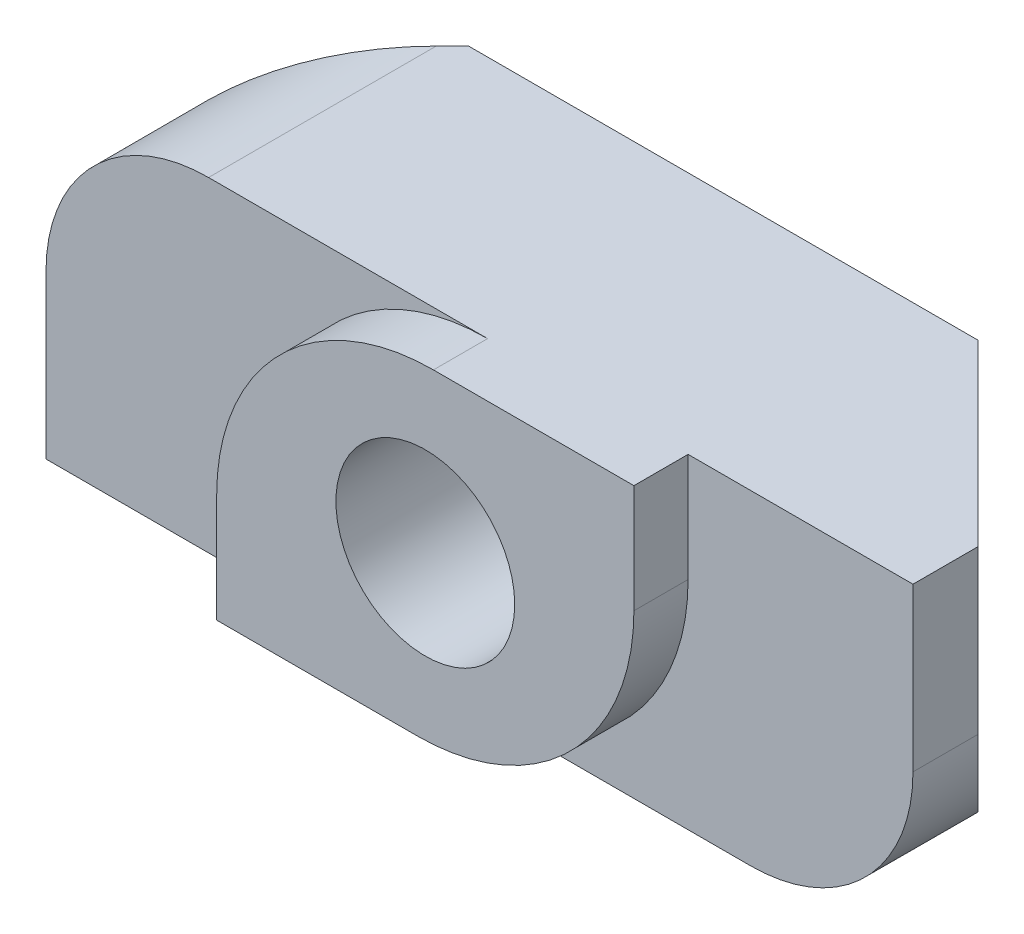
ISO-10303-21;
HEADER;
FILE_DESCRIPTION(('STEP AP214'),'2;1');
FILE_NAME('part.step','',(''),(''),'','','');
FILE_SCHEMA(('AUTOMOTIVE_DESIGN { 1 0 10303 214 1 1 1 1 }'));
ENDSEC;
DATA;
#1=APPLICATION_CONTEXT('core data for automotive mechanical design processes');
#2=APPLICATION_PROTOCOL_DEFINITION('international standard','automotive_design',2000,#1);
#3=PRODUCT_CONTEXT('',#1,'mechanical');
#4=PRODUCT('Part','Part','',(#3));
#5=PRODUCT_RELATED_PRODUCT_CATEGORY('part','',(#4));
#6=PRODUCT_DEFINITION_FORMATION('','',#4);
#7=PRODUCT_DEFINITION_CONTEXT('part definition',#1,'design');
#8=PRODUCT_DEFINITION('design','',#6,#7);
#9=PRODUCT_DEFINITION_SHAPE('','',#8);
#10=(LENGTH_UNIT() NAMED_UNIT(*) SI_UNIT(.MILLI.,.METRE.));
#11=(NAMED_UNIT(*) PLANE_ANGLE_UNIT() SI_UNIT($,.RADIAN.));
#12=(NAMED_UNIT(*) SI_UNIT($,.STERADIAN.) SOLID_ANGLE_UNIT());
#13=UNCERTAINTY_MEASURE_WITH_UNIT(LENGTH_MEASURE(1.E-05),#10,'distance_accuracy_value','');
#14=(GEOMETRIC_REPRESENTATION_CONTEXT(3) GLOBAL_UNCERTAINTY_ASSIGNED_CONTEXT((#13)) GLOBAL_UNIT_ASSIGNED_CONTEXT((#10,
#11,#12)) REPRESENTATION_CONTEXT('',''));
#15=CARTESIAN_POINT('',(0.,0.,0.));
#16=DIRECTION('',(0.,0.,1.));
#17=DIRECTION('',(1.,0.,0.));
#18=AXIS2_PLACEMENT_3D('',#15,#16,#17);
#19=CARTESIAN_POINT('',(-4.70000000000001,6.,0.));
#20=DIRECTION('',(0.707106781186549,0.,0.707106781186546));
#21=DIRECTION('',(0.707106781186546,0.,-0.707106781186549));
#22=AXIS2_PLACEMENT_3D('',#19,#20,#21);
#23=PLANE('',#22);
#24=DIRECTION('',(0.,-1.,0.));
#25=VECTOR('',#24,1.);
#26=CARTESIAN_POINT('',(-8.,6.,3.3));
#27=LINE('',#26,#25);
#28=CARTESIAN_POINT('',(-8.,3.,3.3));
#29=VERTEX_POINT('',#28);
#30=CARTESIAN_POINT('',(-8.,0.,3.3));
#31=VERTEX_POINT('',#30);
#32=EDGE_CURVE('E211',#29,#31,#27,.T.);
#33=ORIENTED_EDGE('',*,*,#32,.F.);
#34=CARTESIAN_POINT('',(-4.99999999999999,3.,0.299999999999985));
#35=DIRECTION('',(0.707106781186549,0.,0.707106781186546));
#36=DIRECTION('',(0.707106781186546,0.,-0.707106781186549));
#37=AXIS2_PLACEMENT_3D('',#34,#35,#36);
#38=ELLIPSE('',#37,4.2426406871193,3.);
#39=CARTESIAN_POINT('',(-4.99999999999999,6.,0.299999999999985));
#40=VERTEX_POINT('',#39);
#41=EDGE_CURVE('E236',#29,#40,#38,.F.);
#42=ORIENTED_EDGE('',*,*,#41,.T.);
#43=DIRECTION('',(-0.707106781186546,0.,0.707106781186549));
#44=VECTOR('',#43,1.);
#45=CARTESIAN_POINT('',(-4.70000000000001,6.,0.));
#46=LINE('',#45,#44);
#47=CARTESIAN_POINT('',(-4.70000000000001,6.,0.));
#48=VERTEX_POINT('',#47);
#49=EDGE_CURVE('E194',#48,#40,#46,.T.);
#50=ORIENTED_EDGE('',*,*,#49,.F.);
#51=DIRECTION('',(0.,-1.,0.));
#52=VECTOR('',#51,1.);
#53=CARTESIAN_POINT('',(-4.70000000000001,6.,0.));
#54=LINE('',#53,#52);
#55=CARTESIAN_POINT('',(-4.70000000000001,0.,0.));
#56=VERTEX_POINT('',#55);
#57=EDGE_CURVE('E172',#48,#56,#54,.T.);
#58=ORIENTED_EDGE('',*,*,#57,.T.);
#59=DIRECTION('',(-0.707106781186546,0.,0.707106781186549));
#60=VECTOR('',#59,1.);
#61=CARTESIAN_POINT('',(-4.70000000000001,0.,0.));
#62=LINE('',#61,#60);
#63=EDGE_CURVE('E173',#56,#31,#62,.T.);
#64=ORIENTED_EDGE('',*,*,#63,.T.);
#65=EDGE_LOOP('',(#33,#42,#50,#58,#64));
#66=FACE_BOUND('',#65,.T.);
#67=ADVANCED_FACE('F35',(#66),#23,.F.);
#68=CARTESIAN_POINT('',(-8.,6.,3.3));
#69=DIRECTION('',(1.,0.,0.));
#70=DIRECTION('',(0.,0.,-1.));
#71=AXIS2_PLACEMENT_3D('',#68,#69,#70);
#72=PLANE('',#71);
#73=DIRECTION('',(0.,-1.,0.));
#74=VECTOR('',#73,1.);
#75=CARTESIAN_POINT('',(-8.,6.,4.5));
#76=LINE('',#75,#74);
#77=CARTESIAN_POINT('',(-8.,3.,4.5));
#78=VERTEX_POINT('',#77);
#79=CARTESIAN_POINT('',(-8.,0.,4.5));
#80=VERTEX_POINT('',#79);
#81=EDGE_CURVE('E209',#78,#80,#76,.T.);
#82=ORIENTED_EDGE('',*,*,#81,.F.);
#83=DIRECTION('',(0.,0.,1.));
#84=VECTOR('',#83,1.);
#85=CARTESIAN_POINT('',(-8.,3.,3.3));
#86=LINE('',#85,#84);
#87=EDGE_CURVE('E234',#78,#29,#86,.F.);
#88=ORIENTED_EDGE('',*,*,#87,.T.);
#89=ORIENTED_EDGE('',*,*,#32,.T.);
#90=DIRECTION('',(0.,0.,1.));
#91=VECTOR('',#90,1.);
#92=CARTESIAN_POINT('',(-8.,0.,3.3));
#93=LINE('',#92,#91);
#94=EDGE_CURVE('E176',#31,#80,#93,.T.);
#95=ORIENTED_EDGE('',*,*,#94,.T.);
#96=EDGE_LOOP('',(#82,#88,#89,#95));
#97=FACE_BOUND('',#96,.T.);
#98=ADVANCED_FACE('F264',(#97),#72,.F.);
#99=CARTESIAN_POINT('',(-8.,6.,4.5));
#100=DIRECTION('',(0.,0.,-1.));
#101=DIRECTION('',(-1.,0.,0.));
#102=AXIS2_PLACEMENT_3D('',#99,#100,#101);
#103=PLANE('',#102);
#104=DIRECTION('',(1.,0.,0.));
#105=VECTOR('',#104,1.);
#106=CARTESIAN_POINT('',(-8.,6.,4.5));
#107=LINE('',#106,#105);
#108=CARTESIAN_POINT('',(-5.,6.,4.5));
#109=VERTEX_POINT('',#108);
#110=CARTESIAN_POINT('',(0.149999999999997,6.,4.5));
#111=VERTEX_POINT('',#110);
#112=EDGE_CURVE('E144',#109,#111,#107,.T.);
#113=ORIENTED_EDGE('',*,*,#112,.F.);
#114=CARTESIAN_POINT('',(-5.,3.,4.5));
#115=DIRECTION('',(0.,0.,-1.));
#116=DIRECTION('',(-1.,0.,0.));
#117=AXIS2_PLACEMENT_3D('',#114,#115,#116);
#118=CIRCLE('',#117,3.);
#119=EDGE_CURVE('E232',#109,#78,#118,.F.);
#120=ORIENTED_EDGE('',*,*,#119,.T.);
#121=ORIENTED_EDGE('',*,*,#81,.T.);
#122=DIRECTION('',(1.,0.,0.));
#123=VECTOR('',#122,1.);
#124=CARTESIAN_POINT('',(-8.,0.,4.5));
#125=LINE('',#124,#123);
#126=CARTESIAN_POINT('',(-3.85,0.,4.5));
#127=VERTEX_POINT('',#126);
#128=EDGE_CURVE('E180',#80,#127,#125,.T.);
#129=ORIENTED_EDGE('',*,*,#128,.T.);
#130=DIRECTION('',(0.,-1.,0.));
#131=VECTOR('',#130,1.);
#132=CARTESIAN_POINT('',(-3.85,6.,4.5));
#133=LINE('',#132,#131);
#134=CARTESIAN_POINT('',(-3.85,2.,4.5));
#135=VERTEX_POINT('',#134);
#136=EDGE_CURVE('E207',#135,#127,#133,.T.);
#137=ORIENTED_EDGE('',*,*,#136,.F.);
#138=CARTESIAN_POINT('',(0.15,2.,4.5));
#139=DIRECTION('',(0.,0.,-1.));
#140=DIRECTION('',(-1.,0.,0.));
#141=AXIS2_PLACEMENT_3D('',#138,#139,#140);
#142=CIRCLE('',#141,4.);
#143=EDGE_CURVE('E223',#135,#111,#142,.T.);
#144=ORIENTED_EDGE('',*,*,#143,.T.);
#145=EDGE_LOOP('',(#113,#120,#121,#129,#137,#144));
#146=FACE_BOUND('',#145,.T.);
#147=ADVANCED_FACE('F270',(#146),#103,.F.);
#148=CARTESIAN_POINT('',(-3.85,6.,4.5));
#149=DIRECTION('',(1.,0.,0.));
#150=DIRECTION('',(0.,0.,-1.));
#151=AXIS2_PLACEMENT_3D('',#148,#149,#150);
#152=PLANE('',#151);
#153=DIRECTION('',(0.,-1.,0.));
#154=VECTOR('',#153,1.);
#155=CARTESIAN_POINT('',(-3.85,6.,5.5));
#156=LINE('',#155,#154);
#157=CARTESIAN_POINT('',(-3.85,2.,5.5));
#158=VERTEX_POINT('',#157);
#159=CARTESIAN_POINT('',(-3.85,0.,5.5));
#160=VERTEX_POINT('',#159);
#161=EDGE_CURVE('E155',#158,#160,#156,.T.);
#162=ORIENTED_EDGE('',*,*,#161,.F.);
#163=DIRECTION('',(0.,0.,1.));
#164=VECTOR('',#163,1.);
#165=CARTESIAN_POINT('',(-3.85,2.,4.5));
#166=LINE('',#165,#164);
#167=EDGE_CURVE('E217',#158,#135,#166,.F.);
#168=ORIENTED_EDGE('',*,*,#167,.T.);
#169=ORIENTED_EDGE('',*,*,#136,.T.);
#170=DIRECTION('',(0.,0.,1.));
#171=VECTOR('',#170,1.);
#172=CARTESIAN_POINT('',(-3.85,0.,4.5));
#173=LINE('',#172,#171);
#174=EDGE_CURVE('E183',#127,#160,#173,.T.);
#175=ORIENTED_EDGE('',*,*,#174,.T.);
#176=EDGE_LOOP('',(#162,#168,#169,#175));
#177=FACE_BOUND('',#176,.T.);
#178=ADVANCED_FACE('F292',(#177),#152,.F.);
#179=CARTESIAN_POINT('',(-3.85,6.,5.5));
#180=DIRECTION('',(0.,0.,-1.));
#181=DIRECTION('',(-1.,0.,0.));
#182=AXIS2_PLACEMENT_3D('',#179,#180,#181);
#183=PLANE('',#182);
#184=CARTESIAN_POINT('',(0.,3.,5.5));
#185=DIRECTION('',(0.,0.,1.));
#186=DIRECTION('',(1.,0.,0.));
#187=AXIS2_PLACEMENT_3D('',#184,#185,#186);
#188=CIRCLE('',#187,1.65);
#189=CARTESIAN_POINT('',(1.65,3.,5.5));
#190=VERTEX_POINT('',#189);
#191=EDGE_CURVE('E307',#190,#190,#188,.T.);
#192=ORIENTED_EDGE('',*,*,#191,.F.);
#193=EDGE_LOOP('',(#192));
#194=FACE_BOUND('',#193,.T.);
#195=DIRECTION('',(1.,0.,0.));
#196=VECTOR('',#195,1.);
#197=CARTESIAN_POINT('',(-3.85,6.,5.5));
#198=LINE('',#197,#196);
#199=CARTESIAN_POINT('',(0.149999999999998,6.,5.5));
#200=VERTEX_POINT('',#199);
#201=CARTESIAN_POINT('',(3.85,6.,5.5));
#202=VERTEX_POINT('',#201);
#203=EDGE_CURVE('E134',#200,#202,#198,.T.);
#204=ORIENTED_EDGE('',*,*,#203,.F.);
#205=CARTESIAN_POINT('',(0.15,2.,5.5));
#206=DIRECTION('',(0.,0.,-1.));
#207=DIRECTION('',(-1.,0.,0.));
#208=AXIS2_PLACEMENT_3D('',#205,#206,#207);
#209=CIRCLE('',#208,4.);
#210=EDGE_CURVE('E215',#200,#158,#209,.F.);
#211=ORIENTED_EDGE('',*,*,#210,.T.);
#212=ORIENTED_EDGE('',*,*,#161,.T.);
#213=DIRECTION('',(1.,0.,0.));
#214=VECTOR('',#213,1.);
#215=CARTESIAN_POINT('',(-3.85,0.,5.5));
#216=LINE('',#215,#214);
#217=CARTESIAN_POINT('',(-0.150000000000001,0.,5.5));
#218=VERTEX_POINT('',#217);
#219=EDGE_CURVE('E186',#160,#218,#216,.T.);
#220=ORIENTED_EDGE('',*,*,#219,.T.);
#221=CARTESIAN_POINT('',(-0.15,4.,5.5));
#222=DIRECTION('',(0.,0.,-1.));
#223=DIRECTION('',(-1.,0.,0.));
#224=AXIS2_PLACEMENT_3D('',#221,#222,#223);
#225=CIRCLE('',#224,4.);
#226=CARTESIAN_POINT('',(3.85,4.,5.5));
#227=VERTEX_POINT('',#226);
#228=EDGE_CURVE('E151',#218,#227,#225,.F.);
#229=ORIENTED_EDGE('',*,*,#228,.T.);
#230=DIRECTION('',(0.,-1.,0.));
#231=VECTOR('',#230,1.);
#232=CARTESIAN_POINT('',(3.85,6.,5.5));
#233=LINE('',#232,#231);
#234=EDGE_CURVE('E147',#202,#227,#233,.T.);
#235=ORIENTED_EDGE('',*,*,#234,.F.);
#236=EDGE_LOOP('',(#204,#211,#212,#220,#229,#235));
#237=FACE_BOUND('',#236,.T.);
#238=ADVANCED_FACE('F148',(#194,#237),#183,.F.);
#239=CARTESIAN_POINT('',(3.85,6.,4.5));
#240=DIRECTION('',(-1.,0.,0.));
#241=DIRECTION('',(0.,0.,1.));
#242=AXIS2_PLACEMENT_3D('',#239,#240,#241);
#243=PLANE('',#242);
#244=ORIENTED_EDGE('',*,*,#234,.T.);
#245=DIRECTION('',(0.,0.,-1.));
#246=VECTOR('',#245,1.);
#247=CARTESIAN_POINT('',(3.85,4.,4.5));
#248=LINE('',#247,#246);
#249=CARTESIAN_POINT('',(3.85,4.,4.5));
#250=VERTEX_POINT('',#249);
#251=EDGE_CURVE('E219',#227,#250,#248,.T.);
#252=ORIENTED_EDGE('',*,*,#251,.T.);
#253=DIRECTION('',(0.,-1.,0.));
#254=VECTOR('',#253,1.);
#255=CARTESIAN_POINT('',(3.85,6.,4.5));
#256=LINE('',#255,#254);
#257=CARTESIAN_POINT('',(3.85,6.,4.5));
#258=VERTEX_POINT('',#257);
#259=EDGE_CURVE('E156',#258,#250,#256,.T.);
#260=ORIENTED_EDGE('',*,*,#259,.F.);
#261=DIRECTION('',(0.,0.,-1.));
#262=VECTOR('',#261,1.);
#263=CARTESIAN_POINT('',(3.85,6.,4.5));
#264=LINE('',#263,#262);
#265=EDGE_CURVE('E139',#202,#258,#264,.T.);
#266=ORIENTED_EDGE('',*,*,#265,.F.);
#267=EDGE_LOOP('',(#244,#252,#260,#266));
#268=FACE_BOUND('',#267,.T.);
#269=ADVANCED_FACE('F158',(#268),#243,.F.);
#270=CARTESIAN_POINT('',(8.,6.,4.5));
#271=DIRECTION('',(0.,0.,-1.));
#272=DIRECTION('',(-1.,0.,0.));
#273=AXIS2_PLACEMENT_3D('',#270,#271,#272);
#274=PLANE('',#273);
#275=DIRECTION('',(1.,0.,0.));
#276=VECTOR('',#275,1.);
#277=CARTESIAN_POINT('',(8.,0.,4.5));
#278=LINE('',#277,#276);
#279=CARTESIAN_POINT('',(-0.15,0.,4.5));
#280=VERTEX_POINT('',#279);
#281=CARTESIAN_POINT('',(5.,0.,4.5));
#282=VERTEX_POINT('',#281);
#283=EDGE_CURVE('E188',#280,#282,#278,.T.);
#284=ORIENTED_EDGE('',*,*,#283,.T.);
#285=CARTESIAN_POINT('',(5.,3.,4.5));
#286=DIRECTION('',(0.,0.,-1.));
#287=DIRECTION('',(-1.,0.,0.));
#288=AXIS2_PLACEMENT_3D('',#285,#286,#287);
#289=CIRCLE('',#288,3.);
#290=CARTESIAN_POINT('',(8.,3.,4.5));
#291=VERTEX_POINT('',#290);
#292=EDGE_CURVE('E11',#282,#291,#289,.F.);
#293=ORIENTED_EDGE('',*,*,#292,.T.);
#294=DIRECTION('',(0.,-1.,0.));
#295=VECTOR('',#294,1.);
#296=CARTESIAN_POINT('',(8.,6.,4.5));
#297=LINE('',#296,#295);
#298=CARTESIAN_POINT('',(8.,6.,4.5));
#299=VERTEX_POINT('',#298);
#300=EDGE_CURVE('E202',#299,#291,#297,.T.);
#301=ORIENTED_EDGE('',*,*,#300,.F.);
#302=DIRECTION('',(1.,0.,0.));
#303=VECTOR('',#302,1.);
#304=CARTESIAN_POINT('',(8.,6.,4.5));
#305=LINE('',#304,#303);
#306=EDGE_CURVE('E161',#258,#299,#305,.T.);
#307=ORIENTED_EDGE('',*,*,#306,.F.);
#308=ORIENTED_EDGE('',*,*,#259,.T.);
#309=CARTESIAN_POINT('',(-0.15,4.,4.5));
#310=DIRECTION('',(0.,0.,-1.));
#311=DIRECTION('',(-1.,0.,0.));
#312=AXIS2_PLACEMENT_3D('',#309,#310,#311);
#313=CIRCLE('',#312,4.);
#314=EDGE_CURVE('E226',#250,#280,#313,.T.);
#315=ORIENTED_EDGE('',*,*,#314,.T.);
#316=EDGE_LOOP('',(#284,#293,#301,#307,#308,#315));
#317=FACE_BOUND('',#316,.T.);
#318=ADVANCED_FACE('F255',(#317),#274,.F.);
#319=CARTESIAN_POINT('',(8.,6.,3.3));
#320=DIRECTION('',(-1.,0.,0.));
#321=DIRECTION('',(0.,0.,1.));
#322=AXIS2_PLACEMENT_3D('',#319,#320,#321);
#323=PLANE('',#322);
#324=ORIENTED_EDGE('',*,*,#300,.T.);
#325=DIRECTION('',(0.,0.,-1.));
#326=VECTOR('',#325,1.);
#327=CARTESIAN_POINT('',(8.,3.,3.3));
#328=LINE('',#327,#326);
#329=CARTESIAN_POINT('',(8.,3.,3.3));
#330=VERTEX_POINT('',#329);
#331=EDGE_CURVE('E238',#291,#330,#328,.T.);
#332=ORIENTED_EDGE('',*,*,#331,.T.);
#333=DIRECTION('',(0.,-1.,0.));
#334=VECTOR('',#333,1.);
#335=CARTESIAN_POINT('',(8.,6.,3.3));
#336=LINE('',#335,#334);
#337=CARTESIAN_POINT('',(8.,6.,3.3));
#338=VERTEX_POINT('',#337);
#339=EDGE_CURVE('E200',#338,#330,#336,.T.);
#340=ORIENTED_EDGE('',*,*,#339,.F.);
#341=DIRECTION('',(0.,0.,-1.));
#342=VECTOR('',#341,1.);
#343=CARTESIAN_POINT('',(8.,6.,3.3));
#344=LINE('',#343,#342);
#345=EDGE_CURVE('E163',#299,#338,#344,.T.);
#346=ORIENTED_EDGE('',*,*,#345,.F.);
#347=EDGE_LOOP('',(#324,#332,#340,#346));
#348=FACE_BOUND('',#347,.T.);
#349=ADVANCED_FACE('F244',(#348),#323,.F.);
#350=CARTESIAN_POINT('',(4.70000000000001,6.,0.));
#351=DIRECTION('',(-0.707106781186549,0.,0.707106781186546));
#352=DIRECTION('',(0.707106781186546,0.,0.707106781186549));
#353=AXIS2_PLACEMENT_3D('',#350,#351,#352);
#354=PLANE('',#353);
#355=ORIENTED_EDGE('',*,*,#339,.T.);
#356=CARTESIAN_POINT('',(4.99999999999999,3.,0.299999999999984));
#357=DIRECTION('',(-0.707106781186549,0.,0.707106781186546));
#358=DIRECTION('',(-0.707106781186546,0.,-0.707106781186549));
#359=AXIS2_PLACEMENT_3D('',#356,#357,#358);
#360=ELLIPSE('',#359,4.2426406871193,3.);
#361=CARTESIAN_POINT('',(4.99999999999999,0.,0.299999999999985));
#362=VERTEX_POINT('',#361);
#363=EDGE_CURVE('E57',#330,#362,#360,.F.);
#364=ORIENTED_EDGE('',*,*,#363,.T.);
#365=DIRECTION('',(-0.707106781186546,0.,-0.707106781186549));
#366=VECTOR('',#365,1.);
#367=CARTESIAN_POINT('',(4.70000000000001,0.,0.));
#368=LINE('',#367,#366);
#369=CARTESIAN_POINT('',(4.70000000000001,0.,0.));
#370=VERTEX_POINT('',#369);
#371=EDGE_CURVE('E190',#362,#370,#368,.T.);
#372=ORIENTED_EDGE('',*,*,#371,.T.);
#373=DIRECTION('',(0.,-1.,0.));
#374=VECTOR('',#373,1.);
#375=CARTESIAN_POINT('',(4.70000000000001,6.,0.));
#376=LINE('',#375,#374);
#377=CARTESIAN_POINT('',(4.70000000000001,6.,0.));
#378=VERTEX_POINT('',#377);
#379=EDGE_CURVE('E197',#378,#370,#376,.T.);
#380=ORIENTED_EDGE('',*,*,#379,.F.);
#381=DIRECTION('',(-0.707106781186546,0.,-0.707106781186549));
#382=VECTOR('',#381,1.);
#383=CARTESIAN_POINT('',(4.70000000000001,6.,0.));
#384=LINE('',#383,#382);
#385=EDGE_CURVE('E168',#338,#378,#384,.T.);
#386=ORIENTED_EDGE('',*,*,#385,.F.);
#387=EDGE_LOOP('',(#355,#364,#372,#380,#386));
#388=FACE_BOUND('',#387,.T.);
#389=ADVANCED_FACE('F250',(#388),#354,.F.);
#390=CARTESIAN_POINT('',(4.70000000000001,6.,0.));
#391=DIRECTION('',(0.,0.,1.));
#392=DIRECTION('',(1.,0.,0.));
#393=AXIS2_PLACEMENT_3D('',#390,#391,#392);
#394=PLANE('',#393);
#395=CARTESIAN_POINT('',(0.,3.,0.));
#396=DIRECTION('',(0.,0.,1.));
#397=DIRECTION('',(1.,0.,0.));
#398=AXIS2_PLACEMENT_3D('',#395,#396,#397);
#399=CIRCLE('',#398,1.65);
#400=CARTESIAN_POINT('',(1.65,3.,0.));
#401=VERTEX_POINT('',#400);
#402=EDGE_CURVE('E177',#401,#401,#399,.T.);
#403=ORIENTED_EDGE('',*,*,#402,.T.);
#404=EDGE_LOOP('',(#403));
#405=FACE_BOUND('',#404,.T.);
#406=DIRECTION('',(-1.,0.,0.));
#407=VECTOR('',#406,1.);
#408=CARTESIAN_POINT('',(4.70000000000001,0.,0.));
#409=LINE('',#408,#407);
#410=EDGE_CURVE('E192',#370,#56,#409,.T.);
#411=ORIENTED_EDGE('',*,*,#410,.T.);
#412=ORIENTED_EDGE('',*,*,#57,.F.);
#413=DIRECTION('',(-1.,0.,0.));
#414=VECTOR('',#413,1.);
#415=CARTESIAN_POINT('',(4.70000000000001,6.,0.));
#416=LINE('',#415,#414);
#417=EDGE_CURVE('E170',#378,#48,#416,.T.);
#418=ORIENTED_EDGE('',*,*,#417,.F.);
#419=ORIENTED_EDGE('',*,*,#379,.T.);
#420=EDGE_LOOP('',(#411,#412,#418,#419));
#421=FACE_BOUND('',#420,.T.);
#422=ADVANCED_FACE('F313',(#405,#421),#394,.F.);
#423=CARTESIAN_POINT('',(0.,6.,0.));
#424=DIRECTION('',(0.,1.,0.));
#425=DIRECTION('',(0.,0.,1.));
#426=AXIS2_PLACEMENT_3D('',#423,#424,#425);
#427=PLANE('',#426);
#428=ORIENTED_EDGE('',*,*,#49,.T.);
#429=DIRECTION('',(0.,0.,1.));
#430=VECTOR('',#429,1.);
#431=CARTESIAN_POINT('',(-5.,6.,4.50000000000001));
#432=LINE('',#431,#430);
#433=EDGE_CURVE('E229',#40,#109,#432,.T.);
#434=ORIENTED_EDGE('',*,*,#433,.T.);
#435=ORIENTED_EDGE('',*,*,#112,.T.);
#436=DIRECTION('',(0.,0.,1.));
#437=VECTOR('',#436,1.);
#438=CARTESIAN_POINT('',(0.15,6.,5.5));
#439=LINE('',#438,#437);
#440=EDGE_CURVE('E142',#111,#200,#439,.T.);
#441=ORIENTED_EDGE('',*,*,#440,.T.);
#442=ORIENTED_EDGE('',*,*,#203,.T.);
#443=ORIENTED_EDGE('',*,*,#265,.T.);
#444=ORIENTED_EDGE('',*,*,#306,.T.);
#445=ORIENTED_EDGE('',*,*,#345,.T.);
#446=ORIENTED_EDGE('',*,*,#385,.T.);
#447=ORIENTED_EDGE('',*,*,#417,.T.);
#448=EDGE_LOOP('',(#428,#434,#435,#441,#442,#443,#444,#445,#446,#447));
#449=FACE_BOUND('',#448,.T.);
#450=ADVANCED_FACE('F137',(#449),#427,.T.);
#451=CARTESIAN_POINT('',(0.,0.,0.));
#452=DIRECTION('',(0.,1.,0.));
#453=DIRECTION('',(0.,0.,1.));
#454=AXIS2_PLACEMENT_3D('',#451,#452,#453);
#455=PLANE('',#454);
#456=ORIENTED_EDGE('',*,*,#371,.F.);
#457=DIRECTION('',(0.,0.,-1.));
#458=VECTOR('',#457,1.);
#459=CARTESIAN_POINT('',(4.99999999999999,0.,0.));
#460=LINE('',#459,#458);
#461=EDGE_CURVE('E43',#362,#282,#460,.F.);
#462=ORIENTED_EDGE('',*,*,#461,.T.);
#463=ORIENTED_EDGE('',*,*,#283,.F.);
#464=DIRECTION('',(0.,0.,-1.));
#465=VECTOR('',#464,1.);
#466=CARTESIAN_POINT('',(-0.15,0.,0.));
#467=LINE('',#466,#465);
#468=EDGE_CURVE('E221',#280,#218,#467,.F.);
#469=ORIENTED_EDGE('',*,*,#468,.T.);
#470=ORIENTED_EDGE('',*,*,#219,.F.);
#471=ORIENTED_EDGE('',*,*,#174,.F.);
#472=ORIENTED_EDGE('',*,*,#128,.F.);
#473=ORIENTED_EDGE('',*,*,#94,.F.);
#474=ORIENTED_EDGE('',*,*,#63,.F.);
#475=ORIENTED_EDGE('',*,*,#410,.F.);
#476=EDGE_LOOP('',(#456,#462,#463,#469,#470,#471,#472,#473,#474,#475));
#477=FACE_BOUND('',#476,.T.);
#478=ADVANCED_FACE('F287',(#477),#455,.F.);
#479=CARTESIAN_POINT('',(0.,3.,0.));
#480=DIRECTION('',(0.,0.,1.));
#481=DIRECTION('',(1.,0.,0.));
#482=AXIS2_PLACEMENT_3D('',#479,#480,#481);
#483=CYLINDRICAL_SURFACE('',#482,1.65);
#484=ORIENTED_EDGE('',*,*,#402,.F.);
#485=EDGE_LOOP('',(#484));
#486=FACE_BOUND('',#485,.T.);
#487=ORIENTED_EDGE('',*,*,#191,.T.);
#488=EDGE_LOOP('',(#487));
#489=FACE_BOUND('',#488,.T.);
#490=ADVANCED_FACE('F279',(#486,#489),#483,.F.);
#491=CARTESIAN_POINT('',(0.15,2.,0.));
#492=DIRECTION('',(0.,0.,-1.));
#493=DIRECTION('',(-1.,0.,0.));
#494=AXIS2_PLACEMENT_3D('',#491,#492,#493);
#495=CYLINDRICAL_SURFACE('',#494,4.);
#496=ORIENTED_EDGE('',*,*,#143,.F.);
#497=ORIENTED_EDGE('',*,*,#167,.F.);
#498=ORIENTED_EDGE('',*,*,#210,.F.);
#499=ORIENTED_EDGE('',*,*,#440,.F.);
#500=EDGE_LOOP('',(#496,#497,#498,#499));
#501=FACE_BOUND('',#500,.T.);
#502=ADVANCED_FACE('F276',(#501),#495,.T.);
#503=CARTESIAN_POINT('',(-0.15,4.,4.5));
#504=DIRECTION('',(0.,0.,-1.));
#505=DIRECTION('',(-1.,0.,0.));
#506=AXIS2_PLACEMENT_3D('',#503,#504,#505);
#507=CYLINDRICAL_SURFACE('',#506,4.);
#508=ORIENTED_EDGE('',*,*,#228,.F.);
#509=ORIENTED_EDGE('',*,*,#468,.F.);
#510=ORIENTED_EDGE('',*,*,#314,.F.);
#511=ORIENTED_EDGE('',*,*,#251,.F.);
#512=EDGE_LOOP('',(#508,#509,#510,#511));
#513=FACE_BOUND('',#512,.T.);
#514=ADVANCED_FACE('F261',(#513),#507,.T.);
#515=CARTESIAN_POINT('',(-4.99999999999999,3.,0.));
#516=DIRECTION('',(0.,0.,-1.));
#517=DIRECTION('',(-1.,0.,0.));
#518=AXIS2_PLACEMENT_3D('',#515,#516,#517);
#519=CYLINDRICAL_SURFACE('',#518,3.);
#520=ORIENTED_EDGE('',*,*,#41,.F.);
#521=ORIENTED_EDGE('',*,*,#87,.F.);
#522=ORIENTED_EDGE('',*,*,#119,.F.);
#523=ORIENTED_EDGE('',*,*,#433,.F.);
#524=EDGE_LOOP('',(#520,#521,#522,#523));
#525=FACE_BOUND('',#524,.T.);
#526=ADVANCED_FACE('F257',(#525),#519,.T.);
#527=CARTESIAN_POINT('',(5.,3.,3.30000000000001));
#528=DIRECTION('',(0.,0.,-1.));
#529=DIRECTION('',(-1.,0.,0.));
#530=AXIS2_PLACEMENT_3D('',#527,#528,#529);
#531=CYLINDRICAL_SURFACE('',#530,3.);
#532=ORIENTED_EDGE('',*,*,#292,.F.);
#533=ORIENTED_EDGE('',*,*,#461,.F.);
#534=ORIENTED_EDGE('',*,*,#363,.F.);
#535=ORIENTED_EDGE('',*,*,#331,.F.);
#536=EDGE_LOOP('',(#532,#533,#534,#535));
#537=FACE_BOUND('',#536,.T.);
#538=ADVANCED_FACE('F37',(#537),#531,.T.);
#539=CLOSED_SHELL('',(#67,#98,#147,#178,#238,#269,#318,#349,#389,#422,#450,#478,#490,#502,#514,
#526,#538));
#540=MANIFOLD_SOLID_BREP('B2',#539);
#541=ADVANCED_BREP_SHAPE_REPRESENTATION('',(#18,#540),#14);
#542=SHAPE_DEFINITION_REPRESENTATION(#9,#541);
ENDSEC;
END-ISO-10303-21;
